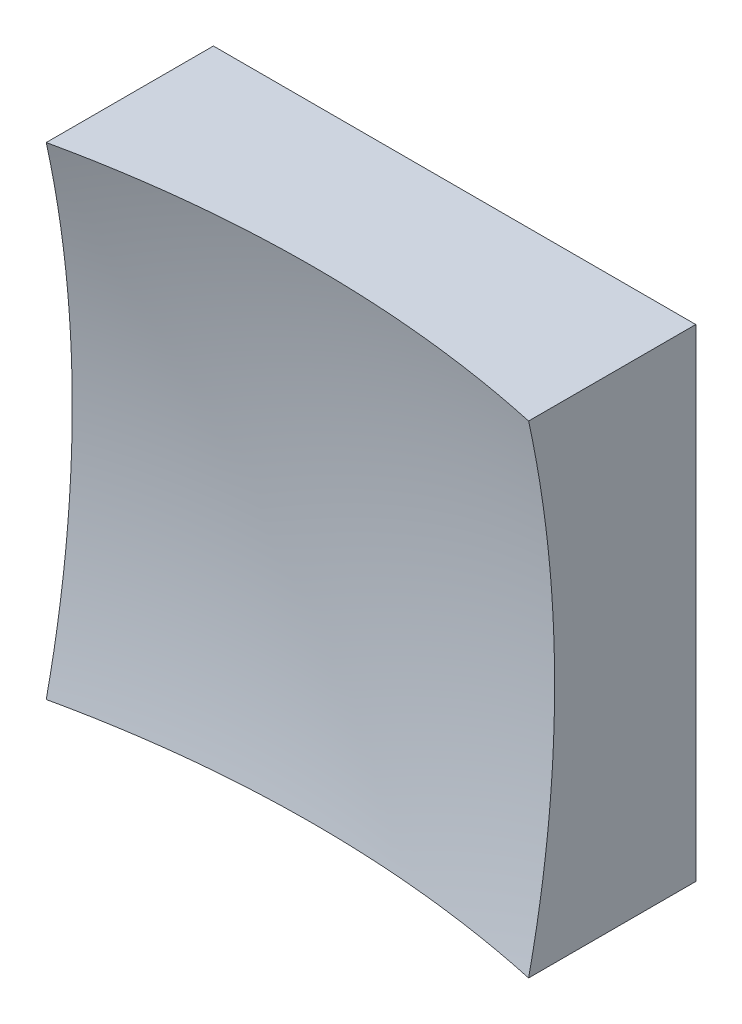
ISO-10303-21;
HEADER;
FILE_DESCRIPTION(('STEP AP214'),'2;1');
FILE_NAME('part.step','',(''),(''),'','','');
FILE_SCHEMA(('AUTOMOTIVE_DESIGN { 1 0 10303 214 1 1 1 1 }'));
ENDSEC;
DATA;
#1=APPLICATION_CONTEXT('core data for automotive mechanical design processes');
#2=APPLICATION_PROTOCOL_DEFINITION('international standard','automotive_design',2000,#1);
#3=PRODUCT_CONTEXT('',#1,'mechanical');
#4=PRODUCT('Part','Part','',(#3));
#5=PRODUCT_RELATED_PRODUCT_CATEGORY('part','',(#4));
#6=PRODUCT_DEFINITION_FORMATION('','',#4);
#7=PRODUCT_DEFINITION_CONTEXT('part definition',#1,'design');
#8=PRODUCT_DEFINITION('design','',#6,#7);
#9=PRODUCT_DEFINITION_SHAPE('','',#8);
#10=(LENGTH_UNIT() NAMED_UNIT(*) SI_UNIT(.MILLI.,.METRE.));
#11=(NAMED_UNIT(*) PLANE_ANGLE_UNIT() SI_UNIT($,.RADIAN.));
#12=(NAMED_UNIT(*) SI_UNIT($,.STERADIAN.) SOLID_ANGLE_UNIT());
#13=UNCERTAINTY_MEASURE_WITH_UNIT(LENGTH_MEASURE(1.E-05),#10,'distance_accuracy_value','');
#14=(GEOMETRIC_REPRESENTATION_CONTEXT(3) GLOBAL_UNCERTAINTY_ASSIGNED_CONTEXT((#13)) GLOBAL_UNIT_ASSIGNED_CONTEXT((#10,
#11,#12)) REPRESENTATION_CONTEXT('',''));
#15=CARTESIAN_POINT('',(0.,0.,0.));
#16=DIRECTION('',(0.,0.,1.));
#17=DIRECTION('',(1.,0.,0.));
#18=AXIS2_PLACEMENT_3D('',#15,#16,#17);
#19=CARTESIAN_POINT('',(-6.25,6.25,10.));
#20=DIRECTION('',(0.,1.,0.));
#21=DIRECTION('',(0.,0.,1.));
#22=AXIS2_PLACEMENT_3D('',#19,#20,#21);
#23=PLANE('',#22);
#24=CARTESIAN_POINT('',(0.,6.25,33.));
#25=DIRECTION('',(0.,1.,0.));
#26=DIRECTION('',(0.,0.,1.));
#27=AXIS2_PLACEMENT_3D('',#24,#25,#26);
#28=CIRCLE('',#27,29.3417364857638);
#29=CARTESIAN_POINT('',(6.25,6.25,4.33163764705071));
#30=VERTEX_POINT('',#29);
#31=CARTESIAN_POINT('',(-6.25,6.25,4.33163764705071));
#32=VERTEX_POINT('',#31);
#33=EDGE_CURVE('E79',#30,#32,#28,.T.);
#34=ORIENTED_EDGE('',*,*,#33,.F.);
#35=DIRECTION('',(0.,0.,-1.));
#36=VECTOR('',#35,1.);
#37=CARTESIAN_POINT('',(6.25,6.25,10.));
#38=LINE('',#37,#36);
#39=CARTESIAN_POINT('',(6.25,6.25,0.));
#40=VERTEX_POINT('',#39);
#41=EDGE_CURVE('E85',#30,#40,#38,.T.);
#42=ORIENTED_EDGE('',*,*,#41,.T.);
#43=DIRECTION('',(1.,0.,0.));
#44=VECTOR('',#43,1.);
#45=CARTESIAN_POINT('',(-6.25,6.25,0.));
#46=LINE('',#45,#44);
#47=CARTESIAN_POINT('',(-6.25,6.25,0.));
#48=VERTEX_POINT('',#47);
#49=EDGE_CURVE('E88',#48,#40,#46,.T.);
#50=ORIENTED_EDGE('',*,*,#49,.F.);
#51=DIRECTION('',(0.,0.,-1.));
#52=VECTOR('',#51,1.);
#53=CARTESIAN_POINT('',(-6.25,6.25,10.));
#54=LINE('',#53,#52);
#55=EDGE_CURVE('E47',#32,#48,#54,.T.);
#56=ORIENTED_EDGE('',*,*,#55,.F.);
#57=EDGE_LOOP('',(#34,#42,#50,#56));
#58=FACE_BOUND('',#57,.T.);
#59=ADVANCED_FACE('F39',(#58),#23,.T.);
#60=CARTESIAN_POINT('',(-6.25,6.25,10.));
#61=DIRECTION('',(1.,0.,0.));
#62=DIRECTION('',(0.,0.,-1.));
#63=AXIS2_PLACEMENT_3D('',#60,#61,#62);
#64=PLANE('',#63);
#65=DIRECTION('',(0.,0.,-1.));
#66=VECTOR('',#65,1.);
#67=CARTESIAN_POINT('',(-6.25,-6.25,10.));
#68=LINE('',#67,#66);
#69=CARTESIAN_POINT('',(-6.25,-6.25,4.33163764705071));
#70=VERTEX_POINT('',#69);
#71=CARTESIAN_POINT('',(-6.25,-6.25,0.));
#72=VERTEX_POINT('',#71);
#73=EDGE_CURVE('E100',#70,#72,#68,.T.);
#74=ORIENTED_EDGE('',*,*,#73,.F.);
#75=CARTESIAN_POINT('',(-6.25,0.,33.));
#76=DIRECTION('',(1.,0.,0.));
#77=DIRECTION('',(0.,0.,-1.));
#78=AXIS2_PLACEMENT_3D('',#75,#76,#77);
#79=CIRCLE('',#78,29.3417364857638);
#80=EDGE_CURVE('E89',#70,#32,#79,.T.);
#81=ORIENTED_EDGE('',*,*,#80,.T.);
#82=ORIENTED_EDGE('',*,*,#55,.T.);
#83=DIRECTION('',(0.,-1.,0.));
#84=VECTOR('',#83,1.);
#85=CARTESIAN_POINT('',(-6.25,6.25,0.));
#86=LINE('',#85,#84);
#87=EDGE_CURVE('E97',#48,#72,#86,.T.);
#88=ORIENTED_EDGE('',*,*,#87,.T.);
#89=EDGE_LOOP('',(#74,#81,#82,#88));
#90=FACE_BOUND('',#89,.T.);
#91=ADVANCED_FACE('F122',(#90),#64,.F.);
#92=CARTESIAN_POINT('',(-6.25,-6.25,10.));
#93=DIRECTION('',(0.,1.,0.));
#94=DIRECTION('',(0.,0.,1.));
#95=AXIS2_PLACEMENT_3D('',#92,#93,#94);
#96=PLANE('',#95);
#97=DIRECTION('',(0.,0.,-1.));
#98=VECTOR('',#97,1.);
#99=CARTESIAN_POINT('',(6.25,-6.25,10.));
#100=LINE('',#99,#98);
#101=CARTESIAN_POINT('',(6.25,-6.25,4.33163764705071));
#102=VERTEX_POINT('',#101);
#103=CARTESIAN_POINT('',(6.25,-6.25,0.));
#104=VERTEX_POINT('',#103);
#105=EDGE_CURVE('E96',#102,#104,#100,.T.);
#106=ORIENTED_EDGE('',*,*,#105,.F.);
#107=CARTESIAN_POINT('',(0.,-6.25,33.));
#108=DIRECTION('',(0.,1.,0.));
#109=DIRECTION('',(0.,0.,1.));
#110=AXIS2_PLACEMENT_3D('',#107,#108,#109);
#111=CIRCLE('',#110,29.3417364857638);
#112=EDGE_CURVE('E53',#102,#70,#111,.T.);
#113=ORIENTED_EDGE('',*,*,#112,.T.);
#114=ORIENTED_EDGE('',*,*,#73,.T.);
#115=DIRECTION('',(1.,0.,0.));
#116=VECTOR('',#115,1.);
#117=CARTESIAN_POINT('',(-6.25,-6.25,0.));
#118=LINE('',#117,#116);
#119=EDGE_CURVE('E102',#72,#104,#118,.T.);
#120=ORIENTED_EDGE('',*,*,#119,.T.);
#121=EDGE_LOOP('',(#106,#113,#114,#120));
#122=FACE_BOUND('',#121,.T.);
#123=ADVANCED_FACE('F121',(#122),#96,.F.);
#124=CARTESIAN_POINT('',(6.25,6.25,10.));
#125=DIRECTION('',(1.,0.,0.));
#126=DIRECTION('',(0.,0.,-1.));
#127=AXIS2_PLACEMENT_3D('',#124,#125,#126);
#128=PLANE('',#127);
#129=CARTESIAN_POINT('',(6.25,0.,33.));
#130=DIRECTION('',(1.,0.,0.));
#131=DIRECTION('',(0.,0.,-1.));
#132=AXIS2_PLACEMENT_3D('',#129,#130,#131);
#133=CIRCLE('',#132,29.3417364857638);
#134=EDGE_CURVE('E11',#102,#30,#133,.T.);
#135=ORIENTED_EDGE('',*,*,#134,.F.);
#136=ORIENTED_EDGE('',*,*,#105,.T.);
#137=DIRECTION('',(0.,-1.,0.));
#138=VECTOR('',#137,1.);
#139=CARTESIAN_POINT('',(6.25,6.25,0.));
#140=LINE('',#139,#138);
#141=EDGE_CURVE('E93',#40,#104,#140,.T.);
#142=ORIENTED_EDGE('',*,*,#141,.F.);
#143=ORIENTED_EDGE('',*,*,#41,.F.);
#144=EDGE_LOOP('',(#135,#136,#142,#143));
#145=FACE_BOUND('',#144,.T.);
#146=ADVANCED_FACE('F91',(#145),#128,.T.);
#147=CARTESIAN_POINT('',(0.,0.,0.));
#148=DIRECTION('',(0.,0.,-1.));
#149=DIRECTION('',(-1.,0.,0.));
#150=AXIS2_PLACEMENT_3D('',#147,#148,#149);
#151=PLANE('',#150);
#152=ORIENTED_EDGE('',*,*,#49,.T.);
#153=ORIENTED_EDGE('',*,*,#141,.T.);
#154=ORIENTED_EDGE('',*,*,#119,.F.);
#155=ORIENTED_EDGE('',*,*,#87,.F.);
#156=EDGE_LOOP('',(#152,#153,#154,#155));
#157=FACE_BOUND('',#156,.T.);
#158=ADVANCED_FACE('F125',(#157),#151,.T.);
#159=CARTESIAN_POINT('',(0.,0.,33.));
#160=DIRECTION('',(0.,0.,1.));
#161=DIRECTION('',(1.,0.,0.));
#162=AXIS2_PLACEMENT_3D('',#159,#160,#161);
#163=SPHERICAL_SURFACE('',#162,30.);
#164=ORIENTED_EDGE('',*,*,#33,.T.);
#165=ORIENTED_EDGE('',*,*,#80,.F.);
#166=ORIENTED_EDGE('',*,*,#112,.F.);
#167=ORIENTED_EDGE('',*,*,#134,.T.);
#168=EDGE_LOOP('',(#164,#165,#166,#167));
#169=FACE_BOUND('',#168,.T.);
#170=ADVANCED_FACE('F78',(#169),#163,.F.);
#171=CLOSED_SHELL('',(#59,#91,#123,#146,#158,#170));
#172=MANIFOLD_SOLID_BREP('B2',#171);
#173=ADVANCED_BREP_SHAPE_REPRESENTATION('',(#18,#172),#14);
#174=SHAPE_DEFINITION_REPRESENTATION(#9,#173);
ENDSEC;
END-ISO-10303-21;
